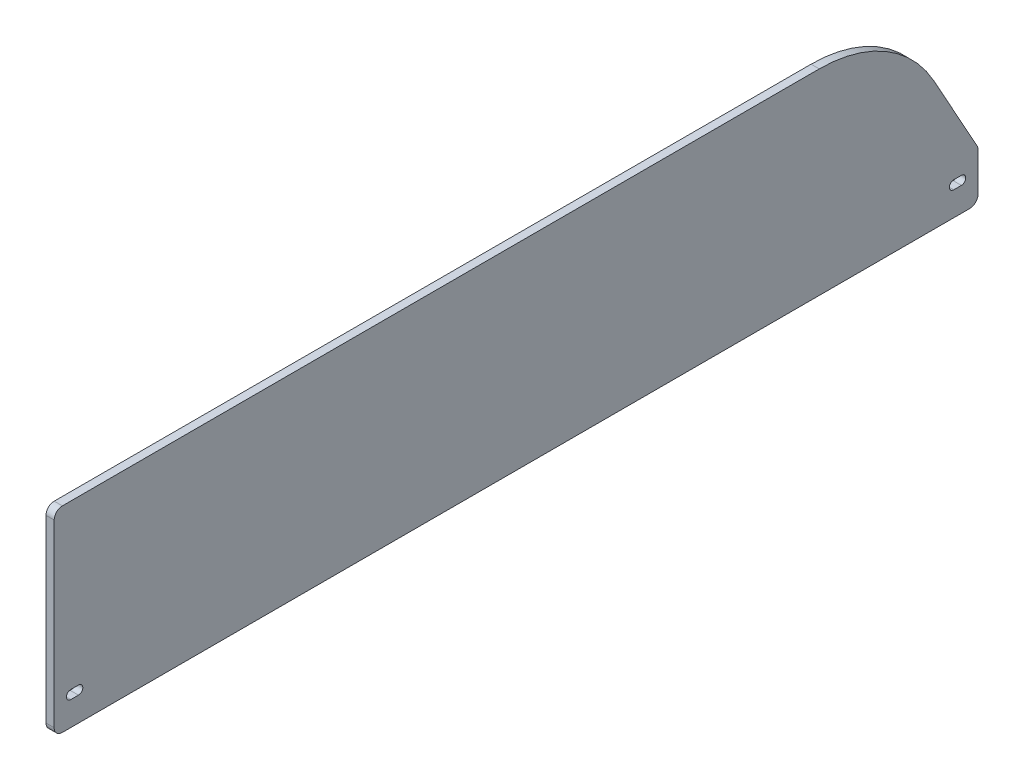
ISO-10303-21;
HEADER;
FILE_DESCRIPTION(('STEP AP214'),'2;1');
FILE_NAME('part.step','',(''),(''),'','','');
FILE_SCHEMA(('AUTOMOTIVE_DESIGN { 1 0 10303 214 1 1 1 1 }'));
ENDSEC;
DATA;
#1=APPLICATION_CONTEXT('core data for automotive mechanical design processes');
#2=APPLICATION_PROTOCOL_DEFINITION('international standard','automotive_design',2000,#1);
#3=PRODUCT_CONTEXT('',#1,'mechanical');
#4=PRODUCT('Part','Part','',(#3));
#5=PRODUCT_RELATED_PRODUCT_CATEGORY('part','',(#4));
#6=PRODUCT_DEFINITION_FORMATION('','',#4);
#7=PRODUCT_DEFINITION_CONTEXT('part definition',#1,'design');
#8=PRODUCT_DEFINITION('design','',#6,#7);
#9=PRODUCT_DEFINITION_SHAPE('','',#8);
#10=(LENGTH_UNIT() NAMED_UNIT(*) SI_UNIT(.MILLI.,.METRE.));
#11=(NAMED_UNIT(*) PLANE_ANGLE_UNIT() SI_UNIT($,.RADIAN.));
#12=(NAMED_UNIT(*) SI_UNIT($,.STERADIAN.) SOLID_ANGLE_UNIT());
#13=UNCERTAINTY_MEASURE_WITH_UNIT(LENGTH_MEASURE(1.E-05),#10,'distance_accuracy_value','');
#14=(GEOMETRIC_REPRESENTATION_CONTEXT(3) GLOBAL_UNCERTAINTY_ASSIGNED_CONTEXT((#13)) GLOBAL_UNIT_ASSIGNED_CONTEXT((#10,
#11,#12)) REPRESENTATION_CONTEXT('',''));
#15=CARTESIAN_POINT('',(0.,0.,0.));
#16=DIRECTION('',(0.,0.,1.));
#17=DIRECTION('',(1.,0.,0.));
#18=AXIS2_PLACEMENT_3D('',#15,#16,#17);
#19=CARTESIAN_POINT('',(6.35,0.,-717.55));
#20=DIRECTION('',(0.,1.,0.));
#21=DIRECTION('',(0.,0.,1.));
#22=AXIS2_PLACEMENT_3D('',#19,#20,#21);
#23=PLANE('',#22);
#24=DIRECTION('',(0.,0.,-1.));
#25=VECTOR('',#24,1.);
#26=CARTESIAN_POINT('',(0.,0.,-717.55));
#27=LINE('',#26,#25);
#28=CARTESIAN_POINT('',(0.,0.,-6.34999999999997));
#29=VERTEX_POINT('',#28);
#30=CARTESIAN_POINT('',(0.,0.,-711.2));
#31=VERTEX_POINT('',#30);
#32=EDGE_CURVE('E434',#29,#31,#27,.T.);
#33=ORIENTED_EDGE('',*,*,#32,.T.);
#34=DIRECTION('',(-1.,0.,0.));
#35=VECTOR('',#34,1.);
#36=CARTESIAN_POINT('',(6.35,0.,-711.2));
#37=LINE('',#36,#35);
#38=CARTESIAN_POINT('',(6.35,0.,-711.2));
#39=VERTEX_POINT('',#38);
#40=EDGE_CURVE('E202',#31,#39,#37,.F.);
#41=ORIENTED_EDGE('',*,*,#40,.T.);
#42=DIRECTION('',(0.,0.,-1.));
#43=VECTOR('',#42,1.);
#44=CARTESIAN_POINT('',(6.35,0.,-717.55));
#45=LINE('',#44,#43);
#46=CARTESIAN_POINT('',(6.35,0.,-6.34999999999997));
#47=VERTEX_POINT('',#46);
#48=EDGE_CURVE('E435',#47,#39,#45,.T.);
#49=ORIENTED_EDGE('',*,*,#48,.F.);
#50=DIRECTION('',(-1.,0.,0.));
#51=VECTOR('',#50,1.);
#52=CARTESIAN_POINT('',(6.35,0.,-6.34999999999997));
#53=LINE('',#52,#51);
#54=EDGE_CURVE('E518',#47,#29,#53,.T.);
#55=ORIENTED_EDGE('',*,*,#54,.T.);
#56=EDGE_LOOP('',(#33,#41,#49,#55));
#57=FACE_BOUND('',#56,.T.);
#58=ADVANCED_FACE('F184',(#57),#23,.F.);
#59=CARTESIAN_POINT('',(6.35,38.1,-717.55));
#60=DIRECTION('',(0.,0.,1.));
#61=DIRECTION('',(1.,0.,0.));
#62=AXIS2_PLACEMENT_3D('',#59,#60,#61);
#63=PLANE('',#62);
#64=DIRECTION('',(0.,1.,0.));
#65=VECTOR('',#64,1.);
#66=CARTESIAN_POINT('',(0.,38.1,-717.55));
#67=LINE('',#66,#65);
#68=CARTESIAN_POINT('',(0.,6.35000000000002,-717.55));
#69=VERTEX_POINT('',#68);
#70=CARTESIAN_POINT('',(0.,36.4545497209464,-717.55));
#71=VERTEX_POINT('',#70);
#72=EDGE_CURVE('E456',#69,#71,#67,.T.);
#73=ORIENTED_EDGE('',*,*,#72,.T.);
#74=DIRECTION('',(-1.,0.,0.));
#75=VECTOR('',#74,1.);
#76=CARTESIAN_POINT('',(6.35,36.4545497209464,-717.55));
#77=LINE('',#76,#75);
#78=CARTESIAN_POINT('',(6.35,36.4545497209464,-717.55));
#79=VERTEX_POINT('',#78);
#80=EDGE_CURVE('E504',#71,#79,#77,.F.);
#81=ORIENTED_EDGE('',*,*,#80,.T.);
#82=DIRECTION('',(0.,1.,0.));
#83=VECTOR('',#82,1.);
#84=CARTESIAN_POINT('',(6.35,38.1,-717.55));
#85=LINE('',#84,#83);
#86=CARTESIAN_POINT('',(6.35,6.35000000000002,-717.55));
#87=VERTEX_POINT('',#86);
#88=EDGE_CURVE('E438',#87,#79,#85,.T.);
#89=ORIENTED_EDGE('',*,*,#88,.F.);
#90=DIRECTION('',(-1.,0.,0.));
#91=VECTOR('',#90,1.);
#92=CARTESIAN_POINT('',(6.35,6.35,-717.55));
#93=LINE('',#92,#91);
#94=EDGE_CURVE('E500',#87,#69,#93,.T.);
#95=ORIENTED_EDGE('',*,*,#94,.T.);
#96=EDGE_LOOP('',(#73,#81,#89,#95));
#97=FACE_BOUND('',#96,.T.);
#98=ADVANCED_FACE('F550',(#97),#63,.F.);
#99=CARTESIAN_POINT('',(6.35,152.4,-654.05));
#100=DIRECTION('',(0.,-0.485642931178632,0.874157276121538));
#101=DIRECTION('',(0.,-0.874157276121538,-0.485642931178632));
#102=AXIS2_PLACEMENT_3D('',#99,#100,#101);
#103=PLANE('',#102);
#104=DIRECTION('',(0.,0.874157276121538,0.485642931178632));
#105=VECTOR('',#104,1.);
#106=CARTESIAN_POINT('',(6.35,152.4,-654.05));
#107=LINE('',#106,#105);
#108=CARTESIAN_POINT('',(6.35,39.5383823339307,-716.750898703372));
#109=VERTEX_POINT('',#108);
#110=CARTESIAN_POINT('',(6.35,100.141321807749,-683.082598995695));
#111=VERTEX_POINT('',#110);
#112=EDGE_CURVE('E443',#109,#111,#107,.T.);
#113=ORIENTED_EDGE('',*,*,#112,.F.);
#114=DIRECTION('',(-1.,0.,0.));
#115=VECTOR('',#114,1.);
#116=CARTESIAN_POINT('',(6.35,39.5383823339307,-716.750898703372));
#117=LINE('',#116,#115);
#118=CARTESIAN_POINT('',(0.,39.5383823339307,-716.750898703372));
#119=VERTEX_POINT('',#118);
#120=EDGE_CURVE('E484',#109,#119,#117,.T.);
#121=ORIENTED_EDGE('',*,*,#120,.T.);
#122=DIRECTION('',(0.,0.874157276121538,0.485642931178632));
#123=VECTOR('',#122,1.);
#124=CARTESIAN_POINT('',(0.,152.4,-654.05));
#125=LINE('',#124,#123);
#126=CARTESIAN_POINT('',(0.,100.141321807749,-683.082598995695));
#127=VERTEX_POINT('',#126);
#128=EDGE_CURVE('E460',#119,#127,#125,.T.);
#129=ORIENTED_EDGE('',*,*,#128,.T.);
#130=DIRECTION('',(-1.,0.,0.));
#131=VECTOR('',#130,1.);
#132=CARTESIAN_POINT('',(6.35,100.141321807749,-683.082598995695));
#133=LINE('',#132,#131);
#134=EDGE_CURVE('E477',#127,#111,#133,.F.);
#135=ORIENTED_EDGE('',*,*,#134,.T.);
#136=EDGE_LOOP('',(#113,#121,#129,#135));
#137=FACE_BOUND('',#136,.T.);
#138=ADVANCED_FACE('F558',(#137),#103,.F.);
#139=CARTESIAN_POINT('',(6.35,152.4,0.));
#140=DIRECTION('',(0.,-1.,0.));
#141=DIRECTION('',(0.,0.,-1.));
#142=AXIS2_PLACEMENT_3D('',#139,#140,#141);
#143=PLANE('',#142);
#144=DIRECTION('',(0.,0.,1.));
#145=VECTOR('',#144,1.);
#146=CARTESIAN_POINT('',(0.,152.4,0.));
#147=LINE('',#146,#145);
#148=CARTESIAN_POINT('',(0.,152.4,-594.268219741747));
#149=VERTEX_POINT('',#148);
#150=CARTESIAN_POINT('',(0.,152.4,-6.35));
#151=VERTEX_POINT('',#150);
#152=EDGE_CURVE('E463',#149,#151,#147,.T.);
#153=ORIENTED_EDGE('',*,*,#152,.T.);
#154=DIRECTION('',(-1.,0.,0.));
#155=VECTOR('',#154,1.);
#156=CARTESIAN_POINT('',(6.35,152.4,-6.35));
#157=LINE('',#156,#155);
#158=CARTESIAN_POINT('',(6.35,152.4,-6.35));
#159=VERTEX_POINT('',#158);
#160=EDGE_CURVE('E13',#151,#159,#157,.F.);
#161=ORIENTED_EDGE('',*,*,#160,.T.);
#162=DIRECTION('',(0.,0.,1.));
#163=VECTOR('',#162,1.);
#164=CARTESIAN_POINT('',(6.35,152.4,0.));
#165=LINE('',#164,#163);
#166=CARTESIAN_POINT('',(6.35,152.4,-594.268219741747));
#167=VERTEX_POINT('',#166);
#168=EDGE_CURVE('E446',#167,#159,#165,.T.);
#169=ORIENTED_EDGE('',*,*,#168,.F.);
#170=DIRECTION('',(-1.,0.,0.));
#171=VECTOR('',#170,1.);
#172=CARTESIAN_POINT('',(6.35,152.4,-594.268219741747));
#173=LINE('',#172,#171);
#174=EDGE_CURVE('E453',#167,#149,#173,.T.);
#175=ORIENTED_EDGE('',*,*,#174,.T.);
#176=EDGE_LOOP('',(#153,#161,#169,#175));
#177=FACE_BOUND('',#176,.T.);
#178=ADVANCED_FACE('F565',(#177),#143,.F.);
#179=CARTESIAN_POINT('',(6.35,0.,0.));
#180=DIRECTION('',(0.,0.,-1.));
#181=DIRECTION('',(-1.,0.,0.));
#182=AXIS2_PLACEMENT_3D('',#179,#180,#181);
#183=PLANE('',#182);
#184=DIRECTION('',(0.,-1.,0.));
#185=VECTOR('',#184,1.);
#186=CARTESIAN_POINT('',(6.35,0.,0.));
#187=LINE('',#186,#185);
#188=CARTESIAN_POINT('',(6.35,146.05,0.));
#189=VERTEX_POINT('',#188);
#190=CARTESIAN_POINT('',(6.35,6.35,0.));
#191=VERTEX_POINT('',#190);
#192=EDGE_CURVE('E450',#189,#191,#187,.T.);
#193=ORIENTED_EDGE('',*,*,#192,.F.);
#194=DIRECTION('',(-1.,0.,0.));
#195=VECTOR('',#194,1.);
#196=CARTESIAN_POINT('',(6.35,146.05,0.));
#197=LINE('',#196,#195);
#198=CARTESIAN_POINT('',(0.,146.05,0.));
#199=VERTEX_POINT('',#198);
#200=EDGE_CURVE('E193',#189,#199,#197,.T.);
#201=ORIENTED_EDGE('',*,*,#200,.T.);
#202=DIRECTION('',(0.,-1.,0.));
#203=VECTOR('',#202,1.);
#204=CARTESIAN_POINT('',(0.,0.,0.));
#205=LINE('',#204,#203);
#206=CARTESIAN_POINT('',(0.,6.35,0.));
#207=VERTEX_POINT('',#206);
#208=EDGE_CURVE('E439',#199,#207,#205,.T.);
#209=ORIENTED_EDGE('',*,*,#208,.T.);
#210=DIRECTION('',(-1.,0.,0.));
#211=VECTOR('',#210,1.);
#212=CARTESIAN_POINT('',(6.35,6.35,0.));
#213=LINE('',#212,#211);
#214=EDGE_CURVE('E524',#207,#191,#213,.F.);
#215=ORIENTED_EDGE('',*,*,#214,.T.);
#216=EDGE_LOOP('',(#193,#201,#209,#215));
#217=FACE_BOUND('',#216,.T.);
#218=ADVANCED_FACE('F532',(#217),#183,.F.);
#219=CARTESIAN_POINT('',(6.35,0.,0.));
#220=DIRECTION('',(-1.,0.,0.));
#221=DIRECTION('',(0.,0.,1.));
#222=AXIS2_PLACEMENT_3D('',#219,#220,#221);
#223=PLANE('',#222);
#224=DIRECTION('',(0.,0.,1.));
#225=VECTOR('',#224,1.);
#226=CARTESIAN_POINT('',(6.35,18.8468,-18.8468));
#227=LINE('',#226,#225);
#228=CARTESIAN_POINT('',(6.35,18.8468,-18.8468));
#229=VERTEX_POINT('',#228);
#230=CARTESIAN_POINT('',(6.35,18.8468,-12.9032));
#231=VERTEX_POINT('',#230);
#232=EDGE_CURVE('E346',#229,#231,#227,.T.);
#233=ORIENTED_EDGE('',*,*,#232,.T.);
#234=CARTESIAN_POINT('',(6.35,22.225,-12.9032));
#235=DIRECTION('',(-1.,0.,0.));
#236=DIRECTION('',(0.,0.,1.));
#237=AXIS2_PLACEMENT_3D('',#234,#235,#236);
#238=CIRCLE('',#237,3.3782);
#239=CARTESIAN_POINT('',(6.35,25.6032,-12.9032));
#240=VERTEX_POINT('',#239);
#241=EDGE_CURVE('E388',#231,#240,#238,.T.);
#242=ORIENTED_EDGE('',*,*,#241,.T.);
#243=DIRECTION('',(0.,0.,1.));
#244=VECTOR('',#243,1.);
#245=CARTESIAN_POINT('',(6.35,25.6032,-18.8468));
#246=LINE('',#245,#244);
#247=CARTESIAN_POINT('',(6.35,25.6032,-18.8468));
#248=VERTEX_POINT('',#247);
#249=EDGE_CURVE('E358',#248,#240,#246,.T.);
#250=ORIENTED_EDGE('',*,*,#249,.F.);
#251=CARTESIAN_POINT('',(6.35,22.225,-18.8468));
#252=DIRECTION('',(-1.,0.,0.));
#253=DIRECTION('',(0.,0.,1.));
#254=AXIS2_PLACEMENT_3D('',#251,#252,#253);
#255=CIRCLE('',#254,3.3782);
#256=EDGE_CURVE('E364',#248,#229,#255,.T.);
#257=ORIENTED_EDGE('',*,*,#256,.T.);
#258=EDGE_LOOP('',(#233,#242,#250,#257));
#259=FACE_BOUND('',#258,.T.);
#260=CARTESIAN_POINT('',(6.35,22.225,-704.6468));
#261=DIRECTION('',(-1.,0.,0.));
#262=DIRECTION('',(0.,0.,1.));
#263=AXIS2_PLACEMENT_3D('',#260,#261,#262);
#264=CIRCLE('',#263,3.3782);
#265=CARTESIAN_POINT('',(6.35,25.6032,-704.6468));
#266=VERTEX_POINT('',#265);
#267=CARTESIAN_POINT('',(6.35,18.8468,-704.6468));
#268=VERTEX_POINT('',#267);
#269=EDGE_CURVE('E414',#266,#268,#264,.T.);
#270=ORIENTED_EDGE('',*,*,#269,.T.);
#271=DIRECTION('',(0.,0.,1.));
#272=VECTOR('',#271,1.);
#273=CARTESIAN_POINT('',(6.35,18.8468,-704.6468));
#274=LINE('',#273,#272);
#275=CARTESIAN_POINT('',(6.35,18.8468,-698.7032));
#276=VERTEX_POINT('',#275);
#277=EDGE_CURVE('E395',#268,#276,#274,.T.);
#278=ORIENTED_EDGE('',*,*,#277,.T.);
#279=CARTESIAN_POINT('',(6.35,22.225,-698.7032));
#280=DIRECTION('',(-1.,0.,0.));
#281=DIRECTION('',(0.,0.,1.));
#282=AXIS2_PLACEMENT_3D('',#279,#280,#281);
#283=CIRCLE('',#282,3.3782);
#284=CARTESIAN_POINT('',(6.35,25.6032,-698.7032));
#285=VERTEX_POINT('',#284);
#286=EDGE_CURVE('E427',#276,#285,#283,.T.);
#287=ORIENTED_EDGE('',*,*,#286,.T.);
#288=DIRECTION('',(0.,0.,1.));
#289=VECTOR('',#288,1.);
#290=CARTESIAN_POINT('',(6.35,25.6032,-704.6468));
#291=LINE('',#290,#289);
#292=EDGE_CURVE('E399',#266,#285,#291,.T.);
#293=ORIENTED_EDGE('',*,*,#292,.F.);
#294=EDGE_LOOP('',(#270,#278,#287,#293));
#295=FACE_BOUND('',#294,.T.);
#296=ORIENTED_EDGE('',*,*,#88,.T.);
#297=CARTESIAN_POINT('',(6.35,36.4545497209464,-711.2));
#298=DIRECTION('',(-1.,0.,0.));
#299=DIRECTION('',(0.,0.,1.));
#300=AXIS2_PLACEMENT_3D('',#297,#298,#299);
#301=CIRCLE('',#300,6.35);
#302=EDGE_CURVE('E515',#79,#109,#301,.F.);
#303=ORIENTED_EDGE('',*,*,#302,.T.);
#304=ORIENTED_EDGE('',*,*,#112,.T.);
#305=CARTESIAN_POINT('',(6.35,50.7999999999999,-594.268219741747));
#306=DIRECTION('',(-1.,0.,0.));
#307=DIRECTION('',(0.,0.,1.));
#308=AXIS2_PLACEMENT_3D('',#305,#306,#307);
#309=CIRCLE('',#308,101.6);
#310=EDGE_CURVE('E481',#111,#167,#309,.F.);
#311=ORIENTED_EDGE('',*,*,#310,.T.);
#312=ORIENTED_EDGE('',*,*,#168,.T.);
#313=CARTESIAN_POINT('',(6.35,146.05,-6.35));
#314=DIRECTION('',(-1.,0.,0.));
#315=DIRECTION('',(0.,0.,1.));
#316=AXIS2_PLACEMENT_3D('',#313,#314,#315);
#317=CIRCLE('',#316,6.35);
#318=EDGE_CURVE('E509',#159,#189,#317,.F.);
#319=ORIENTED_EDGE('',*,*,#318,.T.);
#320=ORIENTED_EDGE('',*,*,#192,.T.);
#321=CARTESIAN_POINT('',(6.35,6.35,-6.34999999999997));
#322=DIRECTION('',(-1.,0.,0.));
#323=DIRECTION('',(0.,0.,1.));
#324=AXIS2_PLACEMENT_3D('',#321,#322,#323);
#325=CIRCLE('',#324,6.35);
#326=EDGE_CURVE('E212',#191,#47,#325,.F.);
#327=ORIENTED_EDGE('',*,*,#326,.T.);
#328=ORIENTED_EDGE('',*,*,#48,.T.);
#329=CARTESIAN_POINT('',(6.35,6.35,-711.2));
#330=DIRECTION('',(-1.,0.,0.));
#331=DIRECTION('',(0.,0.,1.));
#332=AXIS2_PLACEMENT_3D('',#329,#330,#331);
#333=CIRCLE('',#332,6.35);
#334=EDGE_CURVE('E512',#39,#87,#333,.F.);
#335=ORIENTED_EDGE('',*,*,#334,.T.);
#336=EDGE_LOOP('',(#296,#303,#304,#311,#312,#319,#320,#327,#328,#335));
#337=FACE_BOUND('',#336,.T.);
#338=ADVANCED_FACE('F372',(#259,#295,#337),#223,.F.);
#339=CARTESIAN_POINT('',(0.,0.,0.));
#340=DIRECTION('',(-1.,0.,0.));
#341=DIRECTION('',(0.,0.,1.));
#342=AXIS2_PLACEMENT_3D('',#339,#340,#341);
#343=PLANE('',#342);
#344=DIRECTION('',(0.,0.,1.));
#345=VECTOR('',#344,1.);
#346=CARTESIAN_POINT('',(0.,18.8468,-18.8468));
#347=LINE('',#346,#345);
#348=CARTESIAN_POINT('',(0.,18.8468,-18.8468));
#349=VERTEX_POINT('',#348);
#350=CARTESIAN_POINT('',(0.,18.8468,-12.9032));
#351=VERTEX_POINT('',#350);
#352=EDGE_CURVE('E359',#349,#351,#347,.T.);
#353=ORIENTED_EDGE('',*,*,#352,.F.);
#354=CARTESIAN_POINT('',(0.,22.225,-18.8468));
#355=DIRECTION('',(-1.,0.,0.));
#356=DIRECTION('',(0.,0.,1.));
#357=AXIS2_PLACEMENT_3D('',#354,#355,#356);
#358=CIRCLE('',#357,3.3782);
#359=CARTESIAN_POINT('',(0.,25.6032,-18.8468));
#360=VERTEX_POINT('',#359);
#361=EDGE_CURVE('E367',#360,#349,#358,.T.);
#362=ORIENTED_EDGE('',*,*,#361,.F.);
#363=DIRECTION('',(0.,0.,1.));
#364=VECTOR('',#363,1.);
#365=CARTESIAN_POINT('',(0.,25.6032,-18.8468));
#366=LINE('',#365,#364);
#367=CARTESIAN_POINT('',(0.,25.6032,-12.9032));
#368=VERTEX_POINT('',#367);
#369=EDGE_CURVE('E758',#360,#368,#366,.T.);
#370=ORIENTED_EDGE('',*,*,#369,.T.);
#371=CARTESIAN_POINT('',(0.,22.225,-12.9032));
#372=DIRECTION('',(-1.,0.,0.));
#373=DIRECTION('',(0.,0.,1.));
#374=AXIS2_PLACEMENT_3D('',#371,#372,#373);
#375=CIRCLE('',#374,3.3782);
#376=EDGE_CURVE('E385',#351,#368,#375,.T.);
#377=ORIENTED_EDGE('',*,*,#376,.F.);
#378=EDGE_LOOP('',(#353,#362,#370,#377));
#379=FACE_BOUND('',#378,.T.);
#380=DIRECTION('',(0.,0.,1.));
#381=VECTOR('',#380,1.);
#382=CARTESIAN_POINT('',(0.,18.8468,-704.6468));
#383=LINE('',#382,#381);
#384=CARTESIAN_POINT('',(0.,18.8468,-704.6468));
#385=VERTEX_POINT('',#384);
#386=CARTESIAN_POINT('',(0.,18.8468,-698.7032));
#387=VERTEX_POINT('',#386);
#388=EDGE_CURVE('E392',#385,#387,#383,.T.);
#389=ORIENTED_EDGE('',*,*,#388,.F.);
#390=CARTESIAN_POINT('',(0.,22.225,-704.6468));
#391=DIRECTION('',(-1.,0.,0.));
#392=DIRECTION('',(0.,0.,1.));
#393=AXIS2_PLACEMENT_3D('',#390,#391,#392);
#394=CIRCLE('',#393,3.3782);
#395=CARTESIAN_POINT('',(0.,25.6032,-704.6468));
#396=VERTEX_POINT('',#395);
#397=EDGE_CURVE('E410',#396,#385,#394,.T.);
#398=ORIENTED_EDGE('',*,*,#397,.F.);
#399=DIRECTION('',(0.,0.,1.));
#400=VECTOR('',#399,1.);
#401=CARTESIAN_POINT('',(0.,25.6032,-704.6468));
#402=LINE('',#401,#400);
#403=CARTESIAN_POINT('',(0.,25.6032,-698.7032));
#404=VERTEX_POINT('',#403);
#405=EDGE_CURVE('E403',#396,#404,#402,.T.);
#406=ORIENTED_EDGE('',*,*,#405,.T.);
#407=CARTESIAN_POINT('',(0.,22.225,-698.7032));
#408=DIRECTION('',(-1.,0.,0.));
#409=DIRECTION('',(0.,0.,1.));
#410=AXIS2_PLACEMENT_3D('',#407,#408,#409);
#411=CIRCLE('',#410,3.3782);
#412=EDGE_CURVE('E424',#387,#404,#411,.T.);
#413=ORIENTED_EDGE('',*,*,#412,.F.);
#414=EDGE_LOOP('',(#389,#398,#406,#413));
#415=FACE_BOUND('',#414,.T.);
#416=ORIENTED_EDGE('',*,*,#128,.F.);
#417=CARTESIAN_POINT('',(0.,36.4545497209464,-711.2));
#418=DIRECTION('',(-1.,0.,0.));
#419=DIRECTION('',(0.,0.,1.));
#420=AXIS2_PLACEMENT_3D('',#417,#418,#419);
#421=CIRCLE('',#420,6.35);
#422=EDGE_CURVE('E497',#119,#71,#421,.T.);
#423=ORIENTED_EDGE('',*,*,#422,.T.);
#424=ORIENTED_EDGE('',*,*,#72,.F.);
#425=CARTESIAN_POINT('',(0.,6.35,-711.2));
#426=DIRECTION('',(-1.,0.,0.));
#427=DIRECTION('',(0.,0.,1.));
#428=AXIS2_PLACEMENT_3D('',#425,#426,#427);
#429=CIRCLE('',#428,6.35);
#430=EDGE_CURVE('E494',#69,#31,#429,.T.);
#431=ORIENTED_EDGE('',*,*,#430,.T.);
#432=ORIENTED_EDGE('',*,*,#32,.F.);
#433=CARTESIAN_POINT('',(0.,6.35,-6.34999999999997));
#434=DIRECTION('',(-1.,0.,0.));
#435=DIRECTION('',(0.,0.,1.));
#436=AXIS2_PLACEMENT_3D('',#433,#434,#435);
#437=CIRCLE('',#436,6.35);
#438=EDGE_CURVE('E488',#29,#207,#437,.T.);
#439=ORIENTED_EDGE('',*,*,#438,.T.);
#440=ORIENTED_EDGE('',*,*,#208,.F.);
#441=CARTESIAN_POINT('',(0.,146.05,-6.35));
#442=DIRECTION('',(-1.,0.,0.));
#443=DIRECTION('',(0.,0.,1.));
#444=AXIS2_PLACEMENT_3D('',#441,#442,#443);
#445=CIRCLE('',#444,6.35);
#446=EDGE_CURVE('E491',#199,#151,#445,.T.);
#447=ORIENTED_EDGE('',*,*,#446,.T.);
#448=ORIENTED_EDGE('',*,*,#152,.F.);
#449=CARTESIAN_POINT('',(0.,50.7999999999999,-594.268219741747));
#450=DIRECTION('',(-1.,0.,0.));
#451=DIRECTION('',(0.,0.,1.));
#452=AXIS2_PLACEMENT_3D('',#449,#450,#451);
#453=CIRCLE('',#452,101.6);
#454=EDGE_CURVE('E473',#149,#127,#453,.T.);
#455=ORIENTED_EDGE('',*,*,#454,.T.);
#456=EDGE_LOOP('',(#416,#423,#424,#431,#432,#439,#440,#447,#448,#455));
#457=FACE_BOUND('',#456,.T.);
#458=ADVANCED_FACE('F538',(#379,#415,#457),#343,.T.);
#459=CARTESIAN_POINT('',(6.35,50.7999999999999,-594.268219741747));
#460=DIRECTION('',(-1.,0.,0.));
#461=DIRECTION('',(0.,0.,1.));
#462=AXIS2_PLACEMENT_3D('',#459,#460,#461);
#463=CYLINDRICAL_SURFACE('',#462,101.6);
#464=ORIENTED_EDGE('',*,*,#310,.F.);
#465=ORIENTED_EDGE('',*,*,#134,.F.);
#466=ORIENTED_EDGE('',*,*,#454,.F.);
#467=ORIENTED_EDGE('',*,*,#174,.F.);
#468=EDGE_LOOP('',(#464,#465,#466,#467));
#469=FACE_BOUND('',#468,.T.);
#470=ADVANCED_FACE('F567',(#469),#463,.T.);
#471=CARTESIAN_POINT('',(0.,22.225,-698.7032));
#472=DIRECTION('',(-1.,0.,0.));
#473=DIRECTION('',(0.,0.,1.));
#474=AXIS2_PLACEMENT_3D('',#471,#472,#473);
#475=CYLINDRICAL_SURFACE('',#474,3.3782);
#476=ORIENTED_EDGE('',*,*,#412,.T.);
#477=DIRECTION('',(1.,0.,0.));
#478=VECTOR('',#477,1.);
#479=CARTESIAN_POINT('',(6.35,25.6032,-698.7032));
#480=LINE('',#479,#478);
#481=EDGE_CURVE('E421',#404,#285,#480,.T.);
#482=ORIENTED_EDGE('',*,*,#481,.T.);
#483=ORIENTED_EDGE('',*,*,#286,.F.);
#484=DIRECTION('',(-1.,0.,0.));
#485=VECTOR('',#484,1.);
#486=CARTESIAN_POINT('',(0.,18.8468,-698.7032));
#487=LINE('',#486,#485);
#488=EDGE_CURVE('E431',#387,#276,#487,.F.);
#489=ORIENTED_EDGE('',*,*,#488,.F.);
#490=EDGE_LOOP('',(#476,#482,#483,#489));
#491=FACE_BOUND('',#490,.T.);
#492=ADVANCED_FACE('F585',(#491),#475,.F.);
#493=CARTESIAN_POINT('',(0.,22.225,-704.6468));
#494=DIRECTION('',(-1.,0.,0.));
#495=DIRECTION('',(0.,0.,1.));
#496=AXIS2_PLACEMENT_3D('',#493,#494,#495);
#497=CYLINDRICAL_SURFACE('',#496,3.3782);
#498=ORIENTED_EDGE('',*,*,#269,.F.);
#499=DIRECTION('',(1.,0.,0.));
#500=VECTOR('',#499,1.);
#501=CARTESIAN_POINT('',(6.35,25.6032,-704.6468));
#502=LINE('',#501,#500);
#503=EDGE_CURVE('E407',#396,#266,#502,.T.);
#504=ORIENTED_EDGE('',*,*,#503,.F.);
#505=ORIENTED_EDGE('',*,*,#397,.T.);
#506=DIRECTION('',(-1.,0.,0.));
#507=VECTOR('',#506,1.);
#508=CARTESIAN_POINT('',(0.,18.8468,-704.6468));
#509=LINE('',#508,#507);
#510=EDGE_CURVE('E418',#268,#385,#509,.T.);
#511=ORIENTED_EDGE('',*,*,#510,.F.);
#512=EDGE_LOOP('',(#498,#504,#505,#511));
#513=FACE_BOUND('',#512,.T.);
#514=ADVANCED_FACE('F611',(#513),#497,.F.);
#515=CARTESIAN_POINT('',(6.35,25.6032,-704.6468));
#516=DIRECTION('',(0.,-1.,0.));
#517=DIRECTION('',(1.,0.,0.));
#518=AXIS2_PLACEMENT_3D('',#515,#516,#517);
#519=PLANE('',#518);
#520=ORIENTED_EDGE('',*,*,#481,.F.);
#521=ORIENTED_EDGE('',*,*,#405,.F.);
#522=ORIENTED_EDGE('',*,*,#503,.T.);
#523=ORIENTED_EDGE('',*,*,#292,.T.);
#524=EDGE_LOOP('',(#520,#521,#522,#523));
#525=FACE_BOUND('',#524,.T.);
#526=ADVANCED_FACE('F607',(#525),#519,.T.);
#527=CARTESIAN_POINT('',(0.,18.8468,-704.6468));
#528=DIRECTION('',(0.,-1.,0.));
#529=DIRECTION('',(0.,0.,-1.));
#530=AXIS2_PLACEMENT_3D('',#527,#528,#529);
#531=PLANE('',#530);
#532=ORIENTED_EDGE('',*,*,#488,.T.);
#533=ORIENTED_EDGE('',*,*,#277,.F.);
#534=ORIENTED_EDGE('',*,*,#510,.T.);
#535=ORIENTED_EDGE('',*,*,#388,.T.);
#536=EDGE_LOOP('',(#532,#533,#534,#535));
#537=FACE_BOUND('',#536,.T.);
#538=ADVANCED_FACE('F603',(#537),#531,.F.);
#539=CARTESIAN_POINT('',(0.,22.225,-12.9032));
#540=DIRECTION('',(-1.,0.,0.));
#541=DIRECTION('',(0.,0.,1.));
#542=AXIS2_PLACEMENT_3D('',#539,#540,#541);
#543=CYLINDRICAL_SURFACE('',#542,3.3782);
#544=ORIENTED_EDGE('',*,*,#376,.T.);
#545=DIRECTION('',(1.,0.,0.));
#546=VECTOR('',#545,1.);
#547=CARTESIAN_POINT('',(6.35,25.6032,-12.9032));
#548=LINE('',#547,#546);
#549=EDGE_CURVE('E370',#368,#240,#548,.T.);
#550=ORIENTED_EDGE('',*,*,#549,.T.);
#551=ORIENTED_EDGE('',*,*,#241,.F.);
#552=DIRECTION('',(-1.,0.,0.));
#553=VECTOR('',#552,1.);
#554=CARTESIAN_POINT('',(0.,18.8468,-12.9032));
#555=LINE('',#554,#553);
#556=EDGE_CURVE('E352',#351,#231,#555,.F.);
#557=ORIENTED_EDGE('',*,*,#556,.F.);
#558=EDGE_LOOP('',(#544,#550,#551,#557));
#559=FACE_BOUND('',#558,.T.);
#560=ADVANCED_FACE('F600',(#559),#543,.F.);
#561=CARTESIAN_POINT('',(0.,22.225,-18.8468));
#562=DIRECTION('',(-1.,0.,0.));
#563=DIRECTION('',(0.,0.,1.));
#564=AXIS2_PLACEMENT_3D('',#561,#562,#563);
#565=CYLINDRICAL_SURFACE('',#564,3.3782);
#566=ORIENTED_EDGE('',*,*,#256,.F.);
#567=DIRECTION('',(1.,0.,0.));
#568=VECTOR('',#567,1.);
#569=CARTESIAN_POINT('',(6.35,25.6032,-18.8468));
#570=LINE('',#569,#568);
#571=EDGE_CURVE('E379',#360,#248,#570,.T.);
#572=ORIENTED_EDGE('',*,*,#571,.F.);
#573=ORIENTED_EDGE('',*,*,#361,.T.);
#574=DIRECTION('',(-1.,0.,0.));
#575=VECTOR('',#574,1.);
#576=CARTESIAN_POINT('',(0.,18.8468,-18.8468));
#577=LINE('',#576,#575);
#578=EDGE_CURVE('E349',#229,#349,#577,.T.);
#579=ORIENTED_EDGE('',*,*,#578,.F.);
#580=EDGE_LOOP('',(#566,#572,#573,#579));
#581=FACE_BOUND('',#580,.T.);
#582=ADVANCED_FACE('F363',(#581),#565,.F.);
#583=CARTESIAN_POINT('',(6.35,25.6032,-18.8468));
#584=DIRECTION('',(0.,-1.,0.));
#585=DIRECTION('',(1.,0.,0.));
#586=AXIS2_PLACEMENT_3D('',#583,#584,#585);
#587=PLANE('',#586);
#588=ORIENTED_EDGE('',*,*,#549,.F.);
#589=ORIENTED_EDGE('',*,*,#369,.F.);
#590=ORIENTED_EDGE('',*,*,#571,.T.);
#591=ORIENTED_EDGE('',*,*,#249,.T.);
#592=EDGE_LOOP('',(#588,#589,#590,#591));
#593=FACE_BOUND('',#592,.T.);
#594=ADVANCED_FACE('F590',(#593),#587,.T.);
#595=CARTESIAN_POINT('',(0.,18.8468,-18.8468));
#596=DIRECTION('',(0.,-1.,0.));
#597=DIRECTION('',(0.,0.,-1.));
#598=AXIS2_PLACEMENT_3D('',#595,#596,#597);
#599=PLANE('',#598);
#600=ORIENTED_EDGE('',*,*,#556,.T.);
#601=ORIENTED_EDGE('',*,*,#232,.F.);
#602=ORIENTED_EDGE('',*,*,#578,.T.);
#603=ORIENTED_EDGE('',*,*,#352,.T.);
#604=EDGE_LOOP('',(#600,#601,#602,#603));
#605=FACE_BOUND('',#604,.T.);
#606=ADVANCED_FACE('F348',(#605),#599,.F.);
#607=CARTESIAN_POINT('',(6.35,36.4545497209464,-711.2));
#608=DIRECTION('',(-1.,0.,0.));
#609=DIRECTION('',(0.,0.,1.));
#610=AXIS2_PLACEMENT_3D('',#607,#608,#609);
#611=CYLINDRICAL_SURFACE('',#610,6.35);
#612=ORIENTED_EDGE('',*,*,#302,.F.);
#613=ORIENTED_EDGE('',*,*,#80,.F.);
#614=ORIENTED_EDGE('',*,*,#422,.F.);
#615=ORIENTED_EDGE('',*,*,#120,.F.);
#616=EDGE_LOOP('',(#612,#613,#614,#615));
#617=FACE_BOUND('',#616,.T.);
#618=ADVANCED_FACE('F555',(#617),#611,.T.);
#619=CARTESIAN_POINT('',(6.35,6.35,-711.2));
#620=DIRECTION('',(-1.,0.,0.));
#621=DIRECTION('',(0.,0.,1.));
#622=AXIS2_PLACEMENT_3D('',#619,#620,#621);
#623=CYLINDRICAL_SURFACE('',#622,6.35);
#624=ORIENTED_EDGE('',*,*,#334,.F.);
#625=ORIENTED_EDGE('',*,*,#40,.F.);
#626=ORIENTED_EDGE('',*,*,#430,.F.);
#627=ORIENTED_EDGE('',*,*,#94,.F.);
#628=EDGE_LOOP('',(#624,#625,#626,#627));
#629=FACE_BOUND('',#628,.T.);
#630=ADVANCED_FACE('F547',(#629),#623,.T.);
#631=CARTESIAN_POINT('',(6.35,146.05,-6.35));
#632=DIRECTION('',(-1.,0.,0.));
#633=DIRECTION('',(0.,0.,1.));
#634=AXIS2_PLACEMENT_3D('',#631,#632,#633);
#635=CYLINDRICAL_SURFACE('',#634,6.35);
#636=ORIENTED_EDGE('',*,*,#318,.F.);
#637=ORIENTED_EDGE('',*,*,#160,.F.);
#638=ORIENTED_EDGE('',*,*,#446,.F.);
#639=ORIENTED_EDGE('',*,*,#200,.F.);
#640=EDGE_LOOP('',(#636,#637,#638,#639));
#641=FACE_BOUND('',#640,.T.);
#642=ADVANCED_FACE('F568',(#641),#635,.T.);
#643=CARTESIAN_POINT('',(6.35,6.35,-6.34999999999997));
#644=DIRECTION('',(-1.,0.,0.));
#645=DIRECTION('',(0.,0.,1.));
#646=AXIS2_PLACEMENT_3D('',#643,#644,#645);
#647=CYLINDRICAL_SURFACE('',#646,6.35);
#648=ORIENTED_EDGE('',*,*,#326,.F.);
#649=ORIENTED_EDGE('',*,*,#214,.F.);
#650=ORIENTED_EDGE('',*,*,#438,.F.);
#651=ORIENTED_EDGE('',*,*,#54,.F.);
#652=EDGE_LOOP('',(#648,#649,#650,#651));
#653=FACE_BOUND('',#652,.T.);
#654=ADVANCED_FACE('F186',(#653),#647,.T.);
#655=CLOSED_SHELL('',(#58,#98,#138,#178,#218,#338,#458,#470,#492,#514,#526,#538,#560,#582,#594,
#606,#618,#630,#642,#654));
#656=MANIFOLD_SOLID_BREP('B2',#655);
#657=ADVANCED_BREP_SHAPE_REPRESENTATION('',(#18,#656),#14);
#658=SHAPE_DEFINITION_REPRESENTATION(#9,#657);
ENDSEC;
END-ISO-10303-21;
